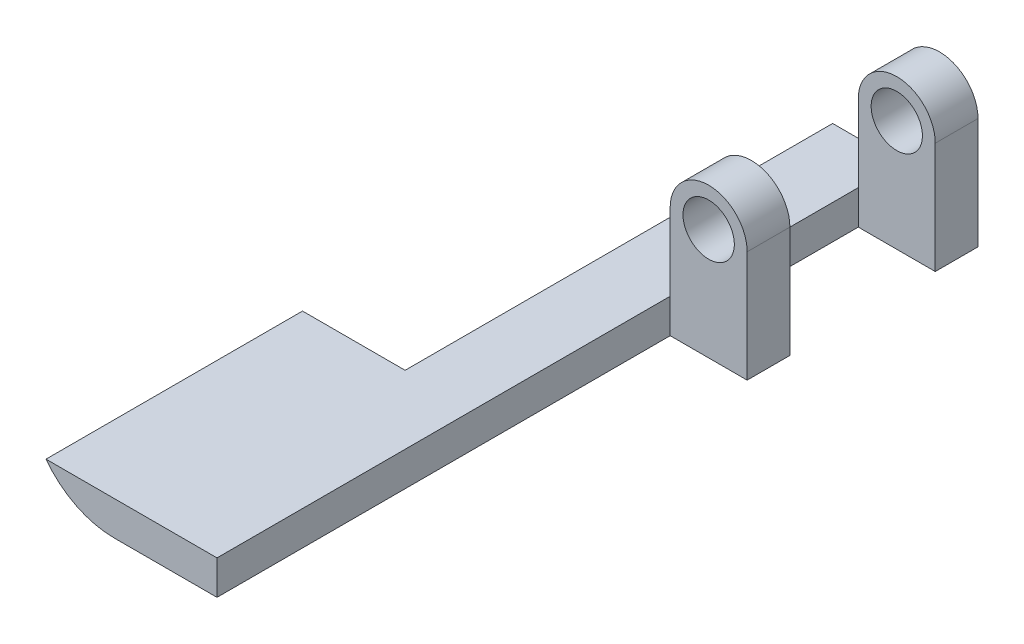
ISO-10303-21;
HEADER;
FILE_DESCRIPTION(('STEP AP214'),'2;1');
FILE_NAME('part.step','',(''),(''),'','','');
FILE_SCHEMA(('AUTOMOTIVE_DESIGN { 1 0 10303 214 1 1 1 1 }'));
ENDSEC;
DATA;
#1=APPLICATION_CONTEXT('core data for automotive mechanical design processes');
#2=APPLICATION_PROTOCOL_DEFINITION('international standard','automotive_design',2000,#1);
#3=PRODUCT_CONTEXT('',#1,'mechanical');
#4=PRODUCT('Part','Part','',(#3));
#5=PRODUCT_RELATED_PRODUCT_CATEGORY('part','',(#4));
#6=PRODUCT_DEFINITION_FORMATION('','',#4);
#7=PRODUCT_DEFINITION_CONTEXT('part definition',#1,'design');
#8=PRODUCT_DEFINITION('design','',#6,#7);
#9=PRODUCT_DEFINITION_SHAPE('','',#8);
#10=(LENGTH_UNIT() NAMED_UNIT(*) SI_UNIT(.MILLI.,.METRE.));
#11=(NAMED_UNIT(*) PLANE_ANGLE_UNIT() SI_UNIT($,.RADIAN.));
#12=(NAMED_UNIT(*) SI_UNIT($,.STERADIAN.) SOLID_ANGLE_UNIT());
#13=UNCERTAINTY_MEASURE_WITH_UNIT(LENGTH_MEASURE(1.E-05),#10,'distance_accuracy_value','');
#14=(GEOMETRIC_REPRESENTATION_CONTEXT(3) GLOBAL_UNCERTAINTY_ASSIGNED_CONTEXT((#13)) GLOBAL_UNIT_ASSIGNED_CONTEXT((#10,
#11,#12)) REPRESENTATION_CONTEXT('',''));
#15=CARTESIAN_POINT('',(0.,0.,0.));
#16=DIRECTION('',(0.,0.,1.));
#17=DIRECTION('',(1.,0.,0.));
#18=AXIS2_PLACEMENT_3D('',#15,#16,#17);
#19=CARTESIAN_POINT('',(50.6295676154831,0.,50.));
#20=DIRECTION('',(-1.,0.,0.));
#21=DIRECTION('',(0.,0.,1.));
#22=AXIS2_PLACEMENT_3D('',#19,#20,#21);
#23=PLANE('',#22);
#24=DIRECTION('',(0.,0.,-1.));
#25=VECTOR('',#24,1.);
#26=CARTESIAN_POINT('',(50.6295676154831,32.9021158128185,50.));
#27=LINE('',#26,#25);
#28=CARTESIAN_POINT('',(50.6295676154831,32.9021158128185,5.00000000000001));
#29=VERTEX_POINT('',#28);
#30=CARTESIAN_POINT('',(50.6295676154831,32.9021158128185,0.));
#31=VERTEX_POINT('',#30);
#32=EDGE_CURVE('E232',#29,#31,#27,.T.);
#33=ORIENTED_EDGE('',*,*,#32,.F.);
#34=DIRECTION('',(0.,-1.,0.));
#35=VECTOR('',#34,1.);
#36=CARTESIAN_POINT('',(50.6295676154831,47.9021158128184,5.));
#37=LINE('',#36,#35);
#38=CARTESIAN_POINT('',(50.6295676154831,19.9021158128185,5.));
#39=VERTEX_POINT('',#38);
#40=EDGE_CURVE('E175',#29,#39,#37,.T.);
#41=ORIENTED_EDGE('',*,*,#40,.T.);
#42=DIRECTION('',(0.,0.,-1.));
#43=VECTOR('',#42,1.);
#44=CARTESIAN_POINT('',(50.6295676154831,19.9021158128185,50.));
#45=LINE('',#44,#43);
#46=CARTESIAN_POINT('',(50.6295676154831,19.9021158128185,0.));
#47=VERTEX_POINT('',#46);
#48=EDGE_CURVE('E235',#39,#47,#45,.T.);
#49=ORIENTED_EDGE('',*,*,#48,.T.);
#50=DIRECTION('',(0.,1.,0.));
#51=VECTOR('',#50,1.);
#52=CARTESIAN_POINT('',(50.6295676154831,0.,0.));
#53=LINE('',#52,#51);
#54=EDGE_CURVE('E211',#47,#31,#53,.T.);
#55=ORIENTED_EDGE('',*,*,#54,.T.);
#56=EDGE_LOOP('',(#33,#41,#49,#55));
#57=FACE_BOUND('',#56,.T.);
#58=ADVANCED_FACE('F35',(#57),#23,.F.);
#59=CARTESIAN_POINT('',(46.1295676154831,32.9021158128185,50.));
#60=DIRECTION('',(0.,0.,-1.));
#61=DIRECTION('',(-1.,0.,0.));
#62=AXIS2_PLACEMENT_3D('',#59,#60,#61);
#63=CYLINDRICAL_SURFACE('',#62,4.5);
#64=CARTESIAN_POINT('',(46.1295676154831,32.9021158128185,5.));
#65=DIRECTION('',(0.,0.,-1.));
#66=DIRECTION('',(-1.,0.,0.));
#67=AXIS2_PLACEMENT_3D('',#64,#65,#66);
#68=CIRCLE('',#67,4.5);
#69=CARTESIAN_POINT('',(41.6295676154831,32.9021158128185,5.));
#70=VERTEX_POINT('',#69);
#71=EDGE_CURVE('E198',#29,#70,#68,.F.);
#72=ORIENTED_EDGE('',*,*,#71,.F.);
#73=ORIENTED_EDGE('',*,*,#32,.T.);
#74=CARTESIAN_POINT('',(46.1295676154831,32.9021158128185,0.));
#75=DIRECTION('',(0.,0.,1.));
#76=DIRECTION('',(1.,0.,0.));
#77=AXIS2_PLACEMENT_3D('',#74,#75,#76);
#78=CIRCLE('',#77,4.5);
#79=CARTESIAN_POINT('',(41.6295676154831,32.9021158128185,0.));
#80=VERTEX_POINT('',#79);
#81=EDGE_CURVE('E214',#80,#31,#78,.F.);
#82=ORIENTED_EDGE('',*,*,#81,.F.);
#83=DIRECTION('',(0.,0.,-1.));
#84=VECTOR('',#83,1.);
#85=CARTESIAN_POINT('',(41.6295676154831,32.9021158128185,50.));
#86=LINE('',#85,#84);
#87=EDGE_CURVE('E228',#70,#80,#86,.T.);
#88=ORIENTED_EDGE('',*,*,#87,.F.);
#89=EDGE_LOOP('',(#72,#73,#82,#88));
#90=FACE_BOUND('',#89,.T.);
#91=ADVANCED_FACE('F277',(#90),#63,.T.);
#92=CARTESIAN_POINT('',(41.6295676154831,0.,50.));
#93=DIRECTION('',(-1.,0.,0.));
#94=DIRECTION('',(0.,-1.,0.));
#95=AXIS2_PLACEMENT_3D('',#92,#93,#94);
#96=PLANE('',#95);
#97=DIRECTION('',(0.,-1.,0.));
#98=VECTOR('',#97,1.);
#99=CARTESIAN_POINT('',(41.6295676154831,47.9021158128184,5.));
#100=LINE('',#99,#98);
#101=CARTESIAN_POINT('',(41.6295676154831,23.9021158128185,5.));
#102=VERTEX_POINT('',#101);
#103=EDGE_CURVE('E179',#70,#102,#100,.T.);
#104=ORIENTED_EDGE('',*,*,#103,.F.);
#105=ORIENTED_EDGE('',*,*,#87,.T.);
#106=DIRECTION('',(0.,1.,0.));
#107=VECTOR('',#106,1.);
#108=CARTESIAN_POINT('',(41.6295676154831,0.,0.));
#109=LINE('',#108,#107);
#110=CARTESIAN_POINT('',(41.6295676154831,23.9021158128185,0.));
#111=VERTEX_POINT('',#110);
#112=EDGE_CURVE('E217',#111,#80,#109,.T.);
#113=ORIENTED_EDGE('',*,*,#112,.F.);
#114=DIRECTION('',(0.,0.,-1.));
#115=VECTOR('',#114,1.);
#116=CARTESIAN_POINT('',(41.6295676154831,23.9021158128185,50.));
#117=LINE('',#116,#115);
#118=EDGE_CURVE('E226',#102,#111,#117,.T.);
#119=ORIENTED_EDGE('',*,*,#118,.F.);
#120=EDGE_LOOP('',(#104,#105,#113,#119));
#121=FACE_BOUND('',#120,.T.);
#122=ADVANCED_FACE('F281',(#121),#96,.T.);
#123=CARTESIAN_POINT('',(46.1295676154831,32.9021158128185,50.));
#124=DIRECTION('',(0.,0.,-1.));
#125=DIRECTION('',(-1.,0.,0.));
#126=AXIS2_PLACEMENT_3D('',#123,#124,#125);
#127=CYLINDRICAL_SURFACE('',#126,3.);
#128=CARTESIAN_POINT('',(46.1295676154831,32.9021158128185,5.));
#129=DIRECTION('',(0.,0.,-1.));
#130=DIRECTION('',(-1.,0.,0.));
#131=AXIS2_PLACEMENT_3D('',#128,#129,#130);
#132=CIRCLE('',#131,3.);
#133=CARTESIAN_POINT('',(43.1295676154831,32.9021158128185,5.));
#134=VERTEX_POINT('',#133);
#135=EDGE_CURVE('E197',#134,#134,#132,.T.);
#136=ORIENTED_EDGE('',*,*,#135,.F.);
#137=EDGE_LOOP('',(#136));
#138=FACE_BOUND('',#137,.T.);
#139=CARTESIAN_POINT('',(46.1295676154831,32.9021158128185,0.));
#140=DIRECTION('',(0.,0.,1.));
#141=DIRECTION('',(1.,0.,0.));
#142=AXIS2_PLACEMENT_3D('',#139,#140,#141);
#143=CIRCLE('',#142,3.);
#144=CARTESIAN_POINT('',(49.1295676154831,32.9021158128185,0.));
#145=VERTEX_POINT('',#144);
#146=EDGE_CURVE('E205',#145,#145,#143,.T.);
#147=ORIENTED_EDGE('',*,*,#146,.F.);
#148=EDGE_LOOP('',(#147));
#149=FACE_BOUND('',#148,.T.);
#150=ADVANCED_FACE('F323',(#138,#149),#127,.F.);
#151=CARTESIAN_POINT('',(33.6295676154831,0.,50.));
#152=DIRECTION('',(-1.,0.,0.));
#153=DIRECTION('',(0.,0.,1.));
#154=AXIS2_PLACEMENT_3D('',#151,#152,#153);
#155=PLANE('',#154);
#156=DIRECTION('',(0.,1.,0.));
#157=VECTOR('',#156,1.);
#158=CARTESIAN_POINT('',(33.6295676154831,0.,0.));
#159=LINE('',#158,#157);
#160=CARTESIAN_POINT('',(33.6295676154831,19.9021158128185,0.));
#161=VERTEX_POINT('',#160);
#162=CARTESIAN_POINT('',(33.6295676154831,23.9021158128185,0.));
#163=VERTEX_POINT('',#162);
#164=EDGE_CURVE('E200',#161,#163,#159,.T.);
#165=ORIENTED_EDGE('',*,*,#164,.F.);
#166=DIRECTION('',(0.,0.,-1.));
#167=VECTOR('',#166,1.);
#168=CARTESIAN_POINT('',(33.6295676154831,19.9021158128185,50.));
#169=LINE('',#168,#167);
#170=CARTESIAN_POINT('',(33.6295676154831,19.9021158128185,50.));
#171=VERTEX_POINT('',#170);
#172=EDGE_CURVE('E238',#171,#161,#169,.T.);
#173=ORIENTED_EDGE('',*,*,#172,.F.);
#174=DIRECTION('',(0.,1.,0.));
#175=VECTOR('',#174,1.);
#176=CARTESIAN_POINT('',(33.6295676154831,0.,50.));
#177=LINE('',#176,#175);
#178=CARTESIAN_POINT('',(33.6295676154831,23.9021158128185,50.));
#179=VERTEX_POINT('',#178);
#180=EDGE_CURVE('E201',#171,#179,#177,.T.);
#181=ORIENTED_EDGE('',*,*,#180,.T.);
#182=DIRECTION('',(0.,0.,-1.));
#183=VECTOR('',#182,1.);
#184=CARTESIAN_POINT('',(33.6295676154831,23.9021158128185,50.));
#185=LINE('',#184,#183);
#186=EDGE_CURVE('E204',#179,#163,#185,.T.);
#187=ORIENTED_EDGE('',*,*,#186,.T.);
#188=EDGE_LOOP('',(#165,#173,#181,#187));
#189=FACE_BOUND('',#188,.T.);
#190=ADVANCED_FACE('F260',(#189),#155,.T.);
#191=CARTESIAN_POINT('',(0.,19.9021158128185,50.));
#192=DIRECTION('',(0.,-1.,0.));
#193=DIRECTION('',(0.,0.,-1.));
#194=AXIS2_PLACEMENT_3D('',#191,#192,#193);
#195=PLANE('',#194);
#196=DIRECTION('',(1.,0.,0.));
#197=VECTOR('',#196,1.);
#198=CARTESIAN_POINT('',(41.6295676154831,19.9021158128185,80.));
#199=LINE('',#198,#197);
#200=CARTESIAN_POINT('',(29.6295676154831,19.9021158128185,80.));
#201=VERTEX_POINT('',#200);
#202=CARTESIAN_POINT('',(41.6295676154831,19.9021158128185,80.));
#203=VERTEX_POINT('',#202);
#204=EDGE_CURVE('E135',#201,#203,#199,.T.);
#205=ORIENTED_EDGE('',*,*,#204,.F.);
#206=DIRECTION('',(0.,0.,-1.));
#207=VECTOR('',#206,1.);
#208=CARTESIAN_POINT('',(29.6295676154831,19.9021158128185,50.));
#209=LINE('',#208,#207);
#210=CARTESIAN_POINT('',(29.6295676154831,19.9021158128185,50.));
#211=VERTEX_POINT('',#210);
#212=EDGE_CURVE('E240',#201,#211,#209,.T.);
#213=ORIENTED_EDGE('',*,*,#212,.T.);
#214=DIRECTION('',(1.,0.,0.));
#215=VECTOR('',#214,1.);
#216=CARTESIAN_POINT('',(41.6295676154831,19.9021158128185,50.));
#217=LINE('',#216,#215);
#218=EDGE_CURVE('E160',#211,#171,#217,.T.);
#219=ORIENTED_EDGE('',*,*,#218,.T.);
#220=ORIENTED_EDGE('',*,*,#172,.T.);
#221=DIRECTION('',(-1.,0.,0.));
#222=VECTOR('',#221,1.);
#223=CARTESIAN_POINT('',(0.,19.9021158128185,0.));
#224=LINE('',#223,#222);
#225=EDGE_CURVE('E208',#47,#161,#224,.T.);
#226=ORIENTED_EDGE('',*,*,#225,.F.);
#227=ORIENTED_EDGE('',*,*,#48,.F.);
#228=DIRECTION('',(1.,0.,0.));
#229=VECTOR('',#228,1.);
#230=CARTESIAN_POINT('',(50.6295676154831,19.9021158128185,5.));
#231=LINE('',#230,#229);
#232=CARTESIAN_POINT('',(41.6295676154831,19.9021158128185,5.));
#233=VERTEX_POINT('',#232);
#234=EDGE_CURVE('E172',#233,#39,#231,.T.);
#235=ORIENTED_EDGE('',*,*,#234,.F.);
#236=DIRECTION('',(0.,0.,-1.));
#237=VECTOR('',#236,1.);
#238=CARTESIAN_POINT('',(41.6295676154831,19.9021158128185,22.));
#239=LINE('',#238,#237);
#240=CARTESIAN_POINT('',(41.6295676154831,19.9021158128185,22.));
#241=VERTEX_POINT('',#240);
#242=EDGE_CURVE('E168',#241,#233,#239,.T.);
#243=ORIENTED_EDGE('',*,*,#242,.F.);
#244=DIRECTION('',(-1.,0.,0.));
#245=VECTOR('',#244,1.);
#246=CARTESIAN_POINT('',(50.6295676154831,19.9021158128185,22.));
#247=LINE('',#246,#245);
#248=CARTESIAN_POINT('',(50.6295676154831,19.9021158128185,22.));
#249=VERTEX_POINT('',#248);
#250=EDGE_CURVE('E165',#249,#241,#247,.T.);
#251=ORIENTED_EDGE('',*,*,#250,.F.);
#252=CARTESIAN_POINT('',(50.6295676154831,19.9021158128185,27.));
#253=VERTEX_POINT('',#252);
#254=EDGE_CURVE('E237',#253,#249,#45,.T.);
#255=ORIENTED_EDGE('',*,*,#254,.F.);
#256=DIRECTION('',(1.,0.,0.));
#257=VECTOR('',#256,1.);
#258=CARTESIAN_POINT('',(41.6295676154831,19.9021158128185,27.));
#259=LINE('',#258,#257);
#260=CARTESIAN_POINT('',(41.6295676154831,19.9021158128185,27.));
#261=VERTEX_POINT('',#260);
#262=EDGE_CURVE('E149',#261,#253,#259,.T.);
#263=ORIENTED_EDGE('',*,*,#262,.F.);
#264=DIRECTION('',(0.,0.,-1.));
#265=VECTOR('',#264,1.);
#266=CARTESIAN_POINT('',(41.6295676154831,19.9021158128185,50.));
#267=LINE('',#266,#265);
#268=EDGE_CURVE('E146',#203,#261,#267,.T.);
#269=ORIENTED_EDGE('',*,*,#268,.F.);
#270=EDGE_LOOP('',(#205,#213,#219,#220,#226,#227,#235,#243,#251,#255,#263,#269));
#271=FACE_BOUND('',#270,.T.);
#272=ADVANCED_FACE('F147',(#271),#195,.T.);
#273=ORIENTED_EDGE('',*,*,#254,.T.);
#274=DIRECTION('',(0.,-1.,0.));
#275=VECTOR('',#274,1.);
#276=CARTESIAN_POINT('',(50.6295676154831,47.9021158128184,22.));
#277=LINE('',#276,#275);
#278=CARTESIAN_POINT('',(50.6295676154831,32.9021158128185,22.));
#279=VERTEX_POINT('',#278);
#280=EDGE_CURVE('E174',#279,#249,#277,.T.);
#281=ORIENTED_EDGE('',*,*,#280,.F.);
#282=CARTESIAN_POINT('',(50.6295676154831,32.9021158128185,27.));
#283=VERTEX_POINT('',#282);
#284=EDGE_CURVE('E234',#283,#279,#27,.T.);
#285=ORIENTED_EDGE('',*,*,#284,.F.);
#286=DIRECTION('',(0.,-1.,0.));
#287=VECTOR('',#286,1.);
#288=CARTESIAN_POINT('',(50.6295676154831,47.9021158128184,27.));
#289=LINE('',#288,#287);
#290=EDGE_CURVE('E169',#283,#253,#289,.T.);
#291=ORIENTED_EDGE('',*,*,#290,.T.);
#292=EDGE_LOOP('',(#273,#281,#285,#291));
#293=FACE_BOUND('',#292,.T.);
#294=ADVANCED_FACE('F294',(#293),#23,.F.);
#295=CARTESIAN_POINT('',(46.1295676154831,32.9021158128185,22.));
#296=DIRECTION('',(0.,0.,1.));
#297=DIRECTION('',(1.,0.,0.));
#298=AXIS2_PLACEMENT_3D('',#295,#296,#297);
#299=CIRCLE('',#298,4.5);
#300=CARTESIAN_POINT('',(41.6295676154831,32.9021158128185,22.));
#301=VERTEX_POINT('',#300);
#302=EDGE_CURVE('E195',#301,#279,#299,.F.);
#303=ORIENTED_EDGE('',*,*,#302,.F.);
#304=CARTESIAN_POINT('',(41.6295676154831,32.9021158128185,27.));
#305=VERTEX_POINT('',#304);
#306=EDGE_CURVE('E231',#305,#301,#86,.T.);
#307=ORIENTED_EDGE('',*,*,#306,.F.);
#308=CARTESIAN_POINT('',(46.1295676154831,32.9021158128185,27.));
#309=DIRECTION('',(0.,0.,-1.));
#310=DIRECTION('',(-1.,0.,0.));
#311=AXIS2_PLACEMENT_3D('',#308,#309,#310);
#312=CIRCLE('',#311,4.5);
#313=EDGE_CURVE('E192',#283,#305,#312,.F.);
#314=ORIENTED_EDGE('',*,*,#313,.F.);
#315=ORIENTED_EDGE('',*,*,#284,.T.);
#316=EDGE_LOOP('',(#303,#307,#314,#315));
#317=FACE_BOUND('',#316,.T.);
#318=ADVANCED_FACE('F306',(#317),#63,.T.);
#319=DIRECTION('',(0.,-1.,0.));
#320=VECTOR('',#319,1.);
#321=CARTESIAN_POINT('',(41.6295676154831,47.9021158128184,22.));
#322=LINE('',#321,#320);
#323=CARTESIAN_POINT('',(41.6295676154831,23.9021158128185,22.));
#324=VERTEX_POINT('',#323);
#325=EDGE_CURVE('E182',#301,#324,#322,.T.);
#326=ORIENTED_EDGE('',*,*,#325,.T.);
#327=CARTESIAN_POINT('',(41.6295676154831,23.9021158128185,27.));
#328=VERTEX_POINT('',#327);
#329=EDGE_CURVE('E229',#328,#324,#117,.T.);
#330=ORIENTED_EDGE('',*,*,#329,.F.);
#331=DIRECTION('',(0.,-1.,0.));
#332=VECTOR('',#331,1.);
#333=CARTESIAN_POINT('',(41.6295676154831,47.9021158128184,27.));
#334=LINE('',#333,#332);
#335=EDGE_CURVE('E190',#305,#328,#334,.T.);
#336=ORIENTED_EDGE('',*,*,#335,.F.);
#337=ORIENTED_EDGE('',*,*,#306,.T.);
#338=EDGE_LOOP('',(#326,#330,#336,#337));
#339=FACE_BOUND('',#338,.T.);
#340=ADVANCED_FACE('F310',(#339),#96,.T.);
#341=CARTESIAN_POINT('',(0.,23.9021158128185,50.));
#342=DIRECTION('',(0.,1.,0.));
#343=DIRECTION('',(-1.,0.,0.));
#344=AXIS2_PLACEMENT_3D('',#341,#342,#343);
#345=PLANE('',#344);
#346=DIRECTION('',(1.,0.,0.));
#347=VECTOR('',#346,1.);
#348=CARTESIAN_POINT('',(0.,23.9021158128185,0.));
#349=LINE('',#348,#347);
#350=EDGE_CURVE('E220',#163,#111,#349,.T.);
#351=ORIENTED_EDGE('',*,*,#350,.F.);
#352=ORIENTED_EDGE('',*,*,#186,.F.);
#353=DIRECTION('',(-1.,0.,0.));
#354=VECTOR('',#353,1.);
#355=CARTESIAN_POINT('',(41.6295676154831,23.9021158128185,50.));
#356=LINE('',#355,#354);
#357=CARTESIAN_POINT('',(21.6295676154831,23.9021158128185,50.));
#358=VERTEX_POINT('',#357);
#359=EDGE_CURVE('E142',#179,#358,#356,.T.);
#360=ORIENTED_EDGE('',*,*,#359,.T.);
#361=DIRECTION('',(0.,0.,-1.));
#362=VECTOR('',#361,1.);
#363=CARTESIAN_POINT('',(21.6295676154831,23.9021158128185,80.));
#364=LINE('',#363,#362);
#365=CARTESIAN_POINT('',(21.6295676154831,23.9021158128185,80.));
#366=VERTEX_POINT('',#365);
#367=EDGE_CURVE('E151',#366,#358,#364,.T.);
#368=ORIENTED_EDGE('',*,*,#367,.F.);
#369=DIRECTION('',(-1.,0.,0.));
#370=VECTOR('',#369,1.);
#371=CARTESIAN_POINT('',(41.6295676154831,23.9021158128185,80.));
#372=LINE('',#371,#370);
#373=CARTESIAN_POINT('',(41.6295676154831,23.9021158128185,80.));
#374=VERTEX_POINT('',#373);
#375=EDGE_CURVE('E156',#374,#366,#372,.T.);
#376=ORIENTED_EDGE('',*,*,#375,.F.);
#377=EDGE_CURVE('E155',#374,#328,#117,.T.);
#378=ORIENTED_EDGE('',*,*,#377,.T.);
#379=ORIENTED_EDGE('',*,*,#329,.T.);
#380=EDGE_CURVE('E287',#324,#102,#117,.T.);
#381=ORIENTED_EDGE('',*,*,#380,.T.);
#382=ORIENTED_EDGE('',*,*,#118,.T.);
#383=EDGE_LOOP('',(#351,#352,#360,#368,#376,#378,#379,#381,#382));
#384=FACE_BOUND('',#383,.T.);
#385=ADVANCED_FACE('F255',(#384),#345,.T.);
#386=CARTESIAN_POINT('',(0.,0.,0.));
#387=DIRECTION('',(0.,0.,1.));
#388=DIRECTION('',(1.,0.,0.));
#389=AXIS2_PLACEMENT_3D('',#386,#387,#388);
#390=PLANE('',#389);
#391=ORIENTED_EDGE('',*,*,#164,.T.);
#392=ORIENTED_EDGE('',*,*,#350,.T.);
#393=ORIENTED_EDGE('',*,*,#112,.T.);
#394=ORIENTED_EDGE('',*,*,#81,.T.);
#395=ORIENTED_EDGE('',*,*,#54,.F.);
#396=ORIENTED_EDGE('',*,*,#225,.T.);
#397=EDGE_LOOP('',(#391,#392,#393,#394,#395,#396));
#398=FACE_BOUND('',#397,.T.);
#399=ORIENTED_EDGE('',*,*,#146,.T.);
#400=EDGE_LOOP('',(#399));
#401=FACE_BOUND('',#400,.T.);
#402=ADVANCED_FACE('F263',(#398,#401),#390,.F.);
#403=CARTESIAN_POINT('',(41.6295676154831,47.9021158128184,50.));
#404=DIRECTION('',(-1.,0.,0.));
#405=DIRECTION('',(0.,0.,1.));
#406=AXIS2_PLACEMENT_3D('',#403,#404,#405);
#407=PLANE('',#406);
#408=ORIENTED_EDGE('',*,*,#377,.F.);
#409=DIRECTION('',(0.,1.,0.));
#410=VECTOR('',#409,1.);
#411=CARTESIAN_POINT('',(41.6295676154831,19.9021158128185,80.));
#412=LINE('',#411,#410);
#413=EDGE_CURVE('E139',#203,#374,#412,.T.);
#414=ORIENTED_EDGE('',*,*,#413,.F.);
#415=ORIENTED_EDGE('',*,*,#268,.T.);
#416=EDGE_CURVE('E187',#328,#261,#334,.T.);
#417=ORIENTED_EDGE('',*,*,#416,.F.);
#418=EDGE_LOOP('',(#408,#414,#415,#417));
#419=FACE_BOUND('',#418,.T.);
#420=ADVANCED_FACE('F153',(#419),#407,.F.);
#421=CARTESIAN_POINT('',(41.6295676154831,47.9021158128184,27.));
#422=DIRECTION('',(0.,0.,-1.));
#423=DIRECTION('',(-1.,0.,0.));
#424=AXIS2_PLACEMENT_3D('',#421,#422,#423);
#425=PLANE('',#424);
#426=ORIENTED_EDGE('',*,*,#313,.T.);
#427=ORIENTED_EDGE('',*,*,#335,.T.);
#428=ORIENTED_EDGE('',*,*,#416,.T.);
#429=ORIENTED_EDGE('',*,*,#262,.T.);
#430=ORIENTED_EDGE('',*,*,#290,.F.);
#431=EDGE_LOOP('',(#426,#427,#428,#429,#430));
#432=FACE_BOUND('',#431,.T.);
#433=CARTESIAN_POINT('',(46.1295676154831,32.9021158128185,27.));
#434=DIRECTION('',(0.,0.,-1.));
#435=DIRECTION('',(-1.,0.,0.));
#436=AXIS2_PLACEMENT_3D('',#433,#434,#435);
#437=CIRCLE('',#436,3.);
#438=CARTESIAN_POINT('',(43.1295676154831,32.9021158128185,27.));
#439=VERTEX_POINT('',#438);
#440=EDGE_CURVE('E178',#439,#439,#437,.T.);
#441=ORIENTED_EDGE('',*,*,#440,.T.);
#442=EDGE_LOOP('',(#441));
#443=FACE_BOUND('',#442,.T.);
#444=ADVANCED_FACE('F299',(#432,#443),#425,.F.);
#445=CARTESIAN_POINT('',(46.1295676154831,32.9021158128185,22.));
#446=DIRECTION('',(0.,0.,1.));
#447=DIRECTION('',(1.,0.,0.));
#448=AXIS2_PLACEMENT_3D('',#445,#446,#447);
#449=CIRCLE('',#448,3.);
#450=CARTESIAN_POINT('',(49.1295676154831,32.9021158128185,22.));
#451=VERTEX_POINT('',#450);
#452=EDGE_CURVE('E194',#451,#451,#449,.T.);
#453=ORIENTED_EDGE('',*,*,#452,.F.);
#454=EDGE_LOOP('',(#453));
#455=FACE_BOUND('',#454,.T.);
#456=ORIENTED_EDGE('',*,*,#440,.F.);
#457=EDGE_LOOP('',(#456));
#458=FACE_BOUND('',#457,.T.);
#459=ADVANCED_FACE('F319',(#455,#458),#127,.F.);
#460=CARTESIAN_POINT('',(50.6295676154831,47.9021158128184,5.));
#461=DIRECTION('',(0.,0.,-1.));
#462=DIRECTION('',(-1.,0.,0.));
#463=AXIS2_PLACEMENT_3D('',#460,#461,#462);
#464=PLANE('',#463);
#465=ORIENTED_EDGE('',*,*,#71,.T.);
#466=ORIENTED_EDGE('',*,*,#103,.T.);
#467=EDGE_CURVE('E180',#102,#233,#100,.T.);
#468=ORIENTED_EDGE('',*,*,#467,.T.);
#469=ORIENTED_EDGE('',*,*,#234,.T.);
#470=ORIENTED_EDGE('',*,*,#40,.F.);
#471=EDGE_LOOP('',(#465,#466,#468,#469,#470));
#472=FACE_BOUND('',#471,.T.);
#473=ORIENTED_EDGE('',*,*,#135,.T.);
#474=EDGE_LOOP('',(#473));
#475=FACE_BOUND('',#474,.T.);
#476=ADVANCED_FACE('F272',(#472,#475),#464,.F.);
#477=CARTESIAN_POINT('',(41.6295676154831,47.9021158128184,22.));
#478=DIRECTION('',(-1.,0.,0.));
#479=DIRECTION('',(0.,0.,1.));
#480=AXIS2_PLACEMENT_3D('',#477,#478,#479);
#481=PLANE('',#480);
#482=ORIENTED_EDGE('',*,*,#380,.F.);
#483=EDGE_CURVE('E183',#324,#241,#322,.T.);
#484=ORIENTED_EDGE('',*,*,#483,.T.);
#485=ORIENTED_EDGE('',*,*,#242,.T.);
#486=ORIENTED_EDGE('',*,*,#467,.F.);
#487=EDGE_LOOP('',(#482,#484,#485,#486));
#488=FACE_BOUND('',#487,.T.);
#489=ADVANCED_FACE('F286',(#488),#481,.F.);
#490=CARTESIAN_POINT('',(50.6295676154831,47.9021158128184,22.));
#491=DIRECTION('',(0.,0.,1.));
#492=DIRECTION('',(1.,0.,0.));
#493=AXIS2_PLACEMENT_3D('',#490,#491,#492);
#494=PLANE('',#493);
#495=ORIENTED_EDGE('',*,*,#302,.T.);
#496=ORIENTED_EDGE('',*,*,#280,.T.);
#497=ORIENTED_EDGE('',*,*,#250,.T.);
#498=ORIENTED_EDGE('',*,*,#483,.F.);
#499=ORIENTED_EDGE('',*,*,#325,.F.);
#500=EDGE_LOOP('',(#495,#496,#497,#498,#499));
#501=FACE_BOUND('',#500,.T.);
#502=ORIENTED_EDGE('',*,*,#452,.T.);
#503=EDGE_LOOP('',(#502));
#504=FACE_BOUND('',#503,.T.);
#505=ADVANCED_FACE('F313',(#501,#504),#494,.F.);
#506=CARTESIAN_POINT('',(0.,0.,50.));
#507=DIRECTION('',(0.,0.,-1.));
#508=DIRECTION('',(-1.,0.,0.));
#509=AXIS2_PLACEMENT_3D('',#506,#507,#508);
#510=PLANE('',#509);
#511=ORIENTED_EDGE('',*,*,#218,.F.);
#512=CARTESIAN_POINT('',(29.6295676154831,29.9021158128185,50.));
#513=DIRECTION('',(0.,0.,-1.));
#514=DIRECTION('',(-1.,0.,0.));
#515=AXIS2_PLACEMENT_3D('',#512,#513,#514);
#516=CIRCLE('',#515,10.);
#517=EDGE_CURVE('E43',#211,#358,#516,.T.);
#518=ORIENTED_EDGE('',*,*,#517,.T.);
#519=ORIENTED_EDGE('',*,*,#359,.F.);
#520=ORIENTED_EDGE('',*,*,#180,.F.);
#521=EDGE_LOOP('',(#511,#518,#519,#520));
#522=FACE_BOUND('',#521,.T.);
#523=ADVANCED_FACE('F249',(#522),#510,.T.);
#524=CARTESIAN_POINT('',(0.,0.,80.));
#525=DIRECTION('',(0.,0.,-1.));
#526=DIRECTION('',(-1.,0.,0.));
#527=AXIS2_PLACEMENT_3D('',#524,#525,#526);
#528=PLANE('',#527);
#529=ORIENTED_EDGE('',*,*,#375,.T.);
#530=CARTESIAN_POINT('',(29.6295676154831,29.9021158128185,80.));
#531=DIRECTION('',(0.,0.,-1.));
#532=DIRECTION('',(-1.,0.,0.));
#533=AXIS2_PLACEMENT_3D('',#530,#531,#532);
#534=CIRCLE('',#533,10.);
#535=EDGE_CURVE('E11',#366,#201,#534,.F.);
#536=ORIENTED_EDGE('',*,*,#535,.T.);
#537=ORIENTED_EDGE('',*,*,#204,.T.);
#538=ORIENTED_EDGE('',*,*,#413,.T.);
#539=EDGE_LOOP('',(#529,#536,#537,#538));
#540=FACE_BOUND('',#539,.T.);
#541=ADVANCED_FACE('F137',(#540),#528,.F.);
#542=CARTESIAN_POINT('',(29.6295676154831,29.9021158128185,80.));
#543=DIRECTION('',(0.,0.,1.));
#544=DIRECTION('',(1.,0.,0.));
#545=AXIS2_PLACEMENT_3D('',#542,#543,#544);
#546=CYLINDRICAL_SURFACE('',#545,10.);
#547=ORIENTED_EDGE('',*,*,#535,.F.);
#548=ORIENTED_EDGE('',*,*,#367,.T.);
#549=ORIENTED_EDGE('',*,*,#517,.F.);
#550=ORIENTED_EDGE('',*,*,#212,.F.);
#551=EDGE_LOOP('',(#547,#548,#549,#550));
#552=FACE_BOUND('',#551,.T.);
#553=ADVANCED_FACE('F37',(#552),#546,.T.);
#554=CLOSED_SHELL('',(#58,#91,#122,#150,#190,#272,#294,#318,#340,#385,#402,#420,#444,#459,#476,
#489,#505,#523,#541,#553));
#555=MANIFOLD_SOLID_BREP('B2',#554);
#556=ADVANCED_BREP_SHAPE_REPRESENTATION('',(#18,#555),#14);
#557=SHAPE_DEFINITION_REPRESENTATION(#9,#556);
ENDSEC;
END-ISO-10303-21;
